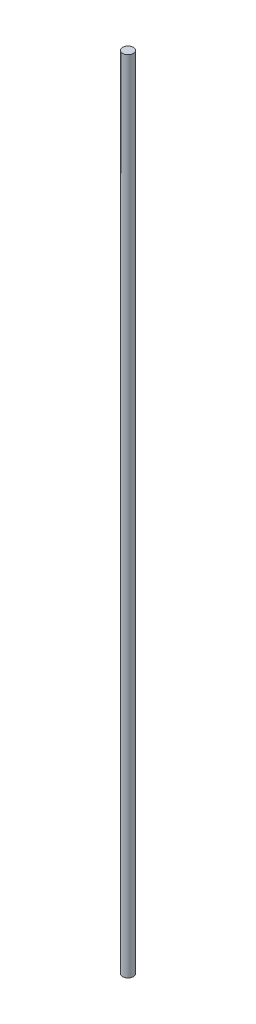
ISO-10303-21;
HEADER;
FILE_DESCRIPTION(('STEP AP214'),'2;1');
FILE_NAME('part.step','',(''),(''),'','','');
FILE_SCHEMA(('AUTOMOTIVE_DESIGN { 1 0 10303 214 1 1 1 1 }'));
ENDSEC;
DATA;
#1=APPLICATION_CONTEXT('core data for automotive mechanical design processes');
#2=APPLICATION_PROTOCOL_DEFINITION('international standard','automotive_design',2000,#1);
#3=PRODUCT_CONTEXT('',#1,'mechanical');
#4=PRODUCT('Part','Part','',(#3));
#5=PRODUCT_RELATED_PRODUCT_CATEGORY('part','',(#4));
#6=PRODUCT_DEFINITION_FORMATION('','',#4);
#7=PRODUCT_DEFINITION_CONTEXT('part definition',#1,'design');
#8=PRODUCT_DEFINITION('design','',#6,#7);
#9=PRODUCT_DEFINITION_SHAPE('','',#8);
#10=(LENGTH_UNIT() NAMED_UNIT(*) SI_UNIT(.MILLI.,.METRE.));
#11=(NAMED_UNIT(*) PLANE_ANGLE_UNIT() SI_UNIT($,.RADIAN.));
#12=(NAMED_UNIT(*) SI_UNIT($,.STERADIAN.) SOLID_ANGLE_UNIT());
#13=UNCERTAINTY_MEASURE_WITH_UNIT(LENGTH_MEASURE(1.E-05),#10,'distance_accuracy_value','');
#14=(GEOMETRIC_REPRESENTATION_CONTEXT(3) GLOBAL_UNCERTAINTY_ASSIGNED_CONTEXT((#13)) GLOBAL_UNIT_ASSIGNED_CONTEXT((#10,
#11,#12)) REPRESENTATION_CONTEXT('',''));
#15=CARTESIAN_POINT('',(0.,0.,0.));
#16=DIRECTION('',(0.,0.,1.));
#17=DIRECTION('',(1.,0.,0.));
#18=AXIS2_PLACEMENT_3D('',#15,#16,#17);
#19=CARTESIAN_POINT('',(0.,150.,0.));
#20=DIRECTION('',(0.,-1.,0.));
#21=DIRECTION('',(0.,0.,-1.));
#22=AXIS2_PLACEMENT_3D('',#19,#20,#21);
#23=CYLINDRICAL_SURFACE('',#22,1.);
#24=CARTESIAN_POINT('',(0.,150.,0.));
#25=DIRECTION('',(0.,1.,0.));
#26=DIRECTION('',(0.,0.,1.));
#27=AXIS2_PLACEMENT_3D('',#24,#25,#26);
#28=CIRCLE('',#27,1.);
#29=CARTESIAN_POINT('',(0.,150.,1.));
#30=VERTEX_POINT('',#29);
#31=EDGE_CURVE('E10',#30,#30,#28,.T.);
#32=ORIENTED_EDGE('',*,*,#31,.F.);
#33=EDGE_LOOP('',(#32));
#34=FACE_BOUND('',#33,.T.);
#35=CARTESIAN_POINT('',(0.,0.,0.));
#36=DIRECTION('',(0.,1.,0.));
#37=DIRECTION('',(0.,0.,1.));
#38=AXIS2_PLACEMENT_3D('',#35,#36,#37);
#39=CIRCLE('',#38,1.);
#40=CARTESIAN_POINT('',(0.,0.,1.));
#41=VERTEX_POINT('',#40);
#42=EDGE_CURVE('E38',#41,#41,#39,.T.);
#43=ORIENTED_EDGE('',*,*,#42,.T.);
#44=EDGE_LOOP('',(#43));
#45=FACE_BOUND('',#44,.T.);
#46=ADVANCED_FACE('F35',(#34,#45),#23,.T.);
#47=CARTESIAN_POINT('',(0.,150.,0.));
#48=DIRECTION('',(0.,1.,0.));
#49=DIRECTION('',(0.,0.,1.));
#50=AXIS2_PLACEMENT_3D('',#47,#48,#49);
#51=PLANE('',#50);
#52=ORIENTED_EDGE('',*,*,#31,.T.);
#53=EDGE_LOOP('',(#52));
#54=FACE_BOUND('',#53,.T.);
#55=ADVANCED_FACE('F50',(#54),#51,.T.);
#56=CARTESIAN_POINT('',(0.,0.,0.));
#57=DIRECTION('',(0.,1.,0.));
#58=DIRECTION('',(0.,0.,1.));
#59=AXIS2_PLACEMENT_3D('',#56,#57,#58);
#60=PLANE('',#59);
#61=ORIENTED_EDGE('',*,*,#42,.F.);
#62=EDGE_LOOP('',(#61));
#63=FACE_BOUND('',#62,.T.);
#64=ADVANCED_FACE('F48',(#63),#60,.F.);
#65=CLOSED_SHELL('',(#46,#55,#64));
#66=MANIFOLD_SOLID_BREP('B2',#65);
#67=ADVANCED_BREP_SHAPE_REPRESENTATION('',(#18,#66),#14);
#68=SHAPE_DEFINITION_REPRESENTATION(#9,#67);
ENDSEC;
END-ISO-10303-21;
